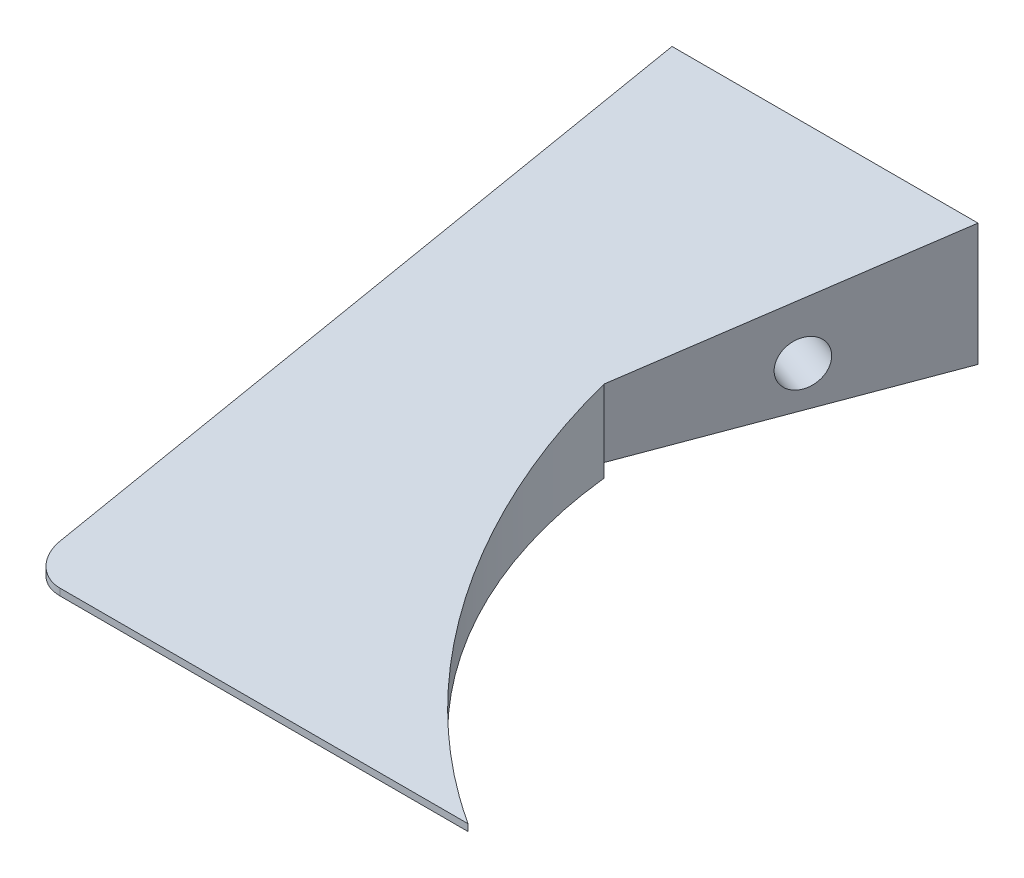
ISO-10303-21;
HEADER;
FILE_DESCRIPTION(('STEP AP214'),'2;1');
FILE_NAME('part.step','',(''),(''),'','','');
FILE_SCHEMA(('AUTOMOTIVE_DESIGN { 1 0 10303 214 1 1 1 1 }'));
ENDSEC;
DATA;
#1=APPLICATION_CONTEXT('core data for automotive mechanical design processes');
#2=APPLICATION_PROTOCOL_DEFINITION('international standard','automotive_design',2000,#1);
#3=PRODUCT_CONTEXT('',#1,'mechanical');
#4=PRODUCT('Part','Part','',(#3));
#5=PRODUCT_RELATED_PRODUCT_CATEGORY('part','',(#4));
#6=PRODUCT_DEFINITION_FORMATION('','',#4);
#7=PRODUCT_DEFINITION_CONTEXT('part definition',#1,'design');
#8=PRODUCT_DEFINITION('design','',#6,#7);
#9=PRODUCT_DEFINITION_SHAPE('','',#8);
#10=(LENGTH_UNIT() NAMED_UNIT(*) SI_UNIT(.MILLI.,.METRE.));
#11=(NAMED_UNIT(*) PLANE_ANGLE_UNIT() SI_UNIT($,.RADIAN.));
#12=(NAMED_UNIT(*) SI_UNIT($,.STERADIAN.) SOLID_ANGLE_UNIT());
#13=UNCERTAINTY_MEASURE_WITH_UNIT(LENGTH_MEASURE(1.E-05),#10,'distance_accuracy_value','');
#14=(GEOMETRIC_REPRESENTATION_CONTEXT(3) GLOBAL_UNCERTAINTY_ASSIGNED_CONTEXT((#13)) GLOBAL_UNIT_ASSIGNED_CONTEXT((#10,
#11,#12)) REPRESENTATION_CONTEXT('',''));
#15=CARTESIAN_POINT('',(0.,0.,0.));
#16=DIRECTION('',(0.,0.,1.));
#17=DIRECTION('',(1.,0.,0.));
#18=AXIS2_PLACEMENT_3D('',#15,#16,#17);
#19=CARTESIAN_POINT('',(0.,0.,95.));
#20=DIRECTION('',(0.,0.,1.));
#21=DIRECTION('',(1.,0.,0.));
#22=AXIS2_PLACEMENT_3D('',#19,#20,#21);
#23=PLANE('',#22);
#24=DIRECTION('',(1.,0.,0.));
#25=VECTOR('',#24,1.);
#26=CARTESIAN_POINT('',(-248.541518069349,-9.,95.));
#27=LINE('',#26,#25);
#28=CARTESIAN_POINT('',(-60.,-9.,95.));
#29=VERTEX_POINT('',#28);
#30=CARTESIAN_POINT('',(0.,-9.,95.));
#31=VERTEX_POINT('',#30);
#32=EDGE_CURVE('E157',#29,#31,#27,.T.);
#33=ORIENTED_EDGE('',*,*,#32,.F.);
#34=DIRECTION('',(0.,-1.,0.));
#35=VECTOR('',#34,1.);
#36=CARTESIAN_POINT('',(-60.,-10.,95.));
#37=LINE('',#36,#35);
#38=CARTESIAN_POINT('',(-60.,-10.,95.));
#39=VERTEX_POINT('',#38);
#40=EDGE_CURVE('E140',#29,#39,#37,.T.);
#41=ORIENTED_EDGE('',*,*,#40,.T.);
#42=DIRECTION('',(1.,0.,0.));
#43=VECTOR('',#42,1.);
#44=CARTESIAN_POINT('',(-65.,-10.,95.));
#45=LINE('',#44,#43);
#46=CARTESIAN_POINT('',(0.,-10.,95.));
#47=VERTEX_POINT('',#46);
#48=EDGE_CURVE('E135',#39,#47,#45,.T.);
#49=ORIENTED_EDGE('',*,*,#48,.T.);
#50=DIRECTION('',(0.,1.,0.));
#51=VECTOR('',#50,1.);
#52=CARTESIAN_POINT('',(0.,-10.001,95.));
#53=LINE('',#52,#51);
#54=EDGE_CURVE('E163',#47,#31,#53,.T.);
#55=ORIENTED_EDGE('',*,*,#54,.T.);
#56=EDGE_LOOP('',(#33,#41,#49,#55));
#57=FACE_BOUND('',#56,.T.);
#58=ADVANCED_FACE('F41',(#57),#23,.T.);
#59=CARTESIAN_POINT('',(-65.,10.,95.));
#60=DIRECTION('',(1.,0.,0.));
#61=DIRECTION('',(0.,0.,-1.));
#62=AXIS2_PLACEMENT_3D('',#59,#60,#61);
#63=PLANE('',#62);
#64=CARTESIAN_POINT('',(-65.,-2.,20.));
#65=DIRECTION('',(-1.,0.,0.));
#66=DIRECTION('',(0.,0.,1.));
#67=AXIS2_PLACEMENT_3D('',#64,#65,#66);
#68=CIRCLE('',#67,3.28999849999999);
#69=CARTESIAN_POINT('',(-65.,-2.,23.2899985));
#70=VERTEX_POINT('',#69);
#71=EDGE_CURVE('E206',#70,#70,#68,.T.);
#72=ORIENTED_EDGE('',*,*,#71,.F.);
#73=EDGE_LOOP('',(#72));
#74=FACE_BOUND('',#73,.T.);
#75=DIRECTION('',(0.,-1.,0.));
#76=VECTOR('',#75,1.);
#77=CARTESIAN_POINT('',(-65.,10.,0.));
#78=LINE('',#77,#76);
#79=CARTESIAN_POINT('',(-65.,10.,0.));
#80=VERTEX_POINT('',#79);
#81=CARTESIAN_POINT('',(-65.,-8.,0.));
#82=VERTEX_POINT('',#81);
#83=EDGE_CURVE('E142',#80,#82,#78,.T.);
#84=ORIENTED_EDGE('',*,*,#83,.T.);
#85=DIRECTION('',(0.,0.,-1.));
#86=VECTOR('',#85,1.);
#87=CARTESIAN_POINT('',(-65.,-8.,40.));
#88=LINE('',#87,#86);
#89=CARTESIAN_POINT('',(-65.,-8.,40.));
#90=VERTEX_POINT('',#89);
#91=EDGE_CURVE('E57',#90,#82,#88,.T.);
#92=ORIENTED_EDGE('',*,*,#91,.F.);
#93=DIRECTION('',(0.,1.,0.));
#94=VECTOR('',#93,1.);
#95=CARTESIAN_POINT('',(-65.,-8.,40.));
#96=LINE('',#95,#94);
#97=CARTESIAN_POINT('',(-65.,-10.,40.));
#98=VERTEX_POINT('',#97);
#99=EDGE_CURVE('E114',#98,#90,#96,.T.);
#100=ORIENTED_EDGE('',*,*,#99,.F.);
#101=DIRECTION('',(0.,0.,-1.));
#102=VECTOR('',#101,1.);
#103=CARTESIAN_POINT('',(-65.,-10.,95.));
#104=LINE('',#103,#102);
#105=CARTESIAN_POINT('',(-65.,-10.,90.));
#106=VERTEX_POINT('',#105);
#107=EDGE_CURVE('E126',#106,#98,#104,.T.);
#108=ORIENTED_EDGE('',*,*,#107,.F.);
#109=DIRECTION('',(0.,-1.,0.));
#110=VECTOR('',#109,1.);
#111=CARTESIAN_POINT('',(-65.,-9.,90.));
#112=LINE('',#111,#110);
#113=CARTESIAN_POINT('',(-65.,-8.,90.));
#114=VERTEX_POINT('',#113);
#115=EDGE_CURVE('E50',#106,#114,#112,.F.);
#116=ORIENTED_EDGE('',*,*,#115,.T.);
#117=DIRECTION('',(0.,-0.196116135138184,0.98058067569092));
#118=VECTOR('',#117,1.);
#119=CARTESIAN_POINT('',(-65.,-8.26923076923077,91.3461538461538));
#120=LINE('',#119,#118);
#121=EDGE_CURVE('E164',#80,#114,#120,.T.);
#122=ORIENTED_EDGE('',*,*,#121,.F.);
#123=EDGE_LOOP('',(#84,#92,#100,#108,#116,#122));
#124=FACE_BOUND('',#123,.T.);
#125=ADVANCED_FACE('F125',(#74,#124),#63,.F.);
#126=CARTESIAN_POINT('',(38.0509567631235,-10.001,32.1493911507396));
#127=DIRECTION('',(0.,1.,0.));
#128=DIRECTION('',(0.,0.,1.));
#129=AXIS2_PLACEMENT_3D('',#126,#127,#128);
#130=CYLINDRICAL_SURFACE('',#129,73.4715886810121);
#131=DIRECTION('',(0.,1.,0.));
#132=VECTOR('',#131,1.);
#133=CARTESIAN_POINT('',(-35.,-10.001,40.));
#134=LINE('',#133,#132);
#135=CARTESIAN_POINT('',(-35.,-10.,40.));
#136=VERTEX_POINT('',#135);
#137=CARTESIAN_POINT('',(-35.,-8.,40.));
#138=VERTEX_POINT('',#137);
#139=EDGE_CURVE('E116',#136,#138,#134,.T.);
#140=ORIENTED_EDGE('',*,*,#139,.T.);
#141=CARTESIAN_POINT('',(-35.,2.,40.));
#142=VERTEX_POINT('',#141);
#143=EDGE_CURVE('E176',#138,#142,#134,.T.);
#144=ORIENTED_EDGE('',*,*,#143,.T.);
#145=CARTESIAN_POINT('',(38.0509567631235,3.57012176985208,32.1493911507396));
#146=DIRECTION('',(0.,0.98058067569092,0.196116135138184));
#147=DIRECTION('',(0.,0.196116135138184,-0.98058067569092));
#148=AXIS2_PLACEMENT_3D('',#145,#146,#147);
#149=ELLIPSE('',#148,74.9266128758287,73.4715886810121);
#150=EDGE_CURVE('E170',#142,#31,#149,.T.);
#151=ORIENTED_EDGE('',*,*,#150,.T.);
#152=ORIENTED_EDGE('',*,*,#54,.F.);
#153=CARTESIAN_POINT('',(38.0509567631235,-10.,32.1493911507396));
#154=DIRECTION('',(0.,1.,0.));
#155=DIRECTION('',(0.,0.,1.));
#156=AXIS2_PLACEMENT_3D('',#153,#154,#155);
#157=CIRCLE('',#156,73.4715886810121);
#158=EDGE_CURVE('E160',#136,#47,#157,.T.);
#159=ORIENTED_EDGE('',*,*,#158,.F.);
#160=EDGE_LOOP('',(#140,#144,#151,#152,#159));
#161=FACE_BOUND('',#160,.T.);
#162=ADVANCED_FACE('F218',(#161),#130,.F.);
#163=CARTESIAN_POINT('',(-35.,-10.001,40.));
#164=DIRECTION('',(0.936329177569045,0.,0.351123441588392));
#165=DIRECTION('',(0.351123441588392,0.,-0.936329177569045));
#166=AXIS2_PLACEMENT_3D('',#163,#164,#165);
#167=PLANE('',#166);
#168=DIRECTION('',(-0.351123441588392,0.,0.936329177569045));
#169=VECTOR('',#168,1.);
#170=CARTESIAN_POINT('',(-35.,-8.,40.));
#171=LINE('',#170,#169);
#172=CARTESIAN_POINT('',(-20.,-8.,0.));
#173=VERTEX_POINT('',#172);
#174=EDGE_CURVE('E195',#173,#138,#171,.T.);
#175=ORIENTED_EDGE('',*,*,#174,.F.);
#176=DIRECTION('',(0.,1.,0.));
#177=VECTOR('',#176,1.);
#178=CARTESIAN_POINT('',(-20.,-10.001,0.));
#179=LINE('',#178,#177);
#180=CARTESIAN_POINT('',(-20.,10.,0.));
#181=VERTEX_POINT('',#180);
#182=EDGE_CURVE('E168',#173,#181,#179,.T.);
#183=ORIENTED_EDGE('',*,*,#182,.T.);
#184=DIRECTION('',(-0.345124094421928,-0.184066183691695,0.920330918458474));
#185=VECTOR('',#184,1.);
#186=CARTESIAN_POINT('',(-35.7623716251985,1.59340179989412,42.0329910005294));
#187=LINE('',#186,#185);
#188=EDGE_CURVE('E134',#181,#142,#187,.T.);
#189=ORIENTED_EDGE('',*,*,#188,.T.);
#190=ORIENTED_EDGE('',*,*,#143,.F.);
#191=EDGE_LOOP('',(#175,#183,#189,#190));
#192=FACE_BOUND('',#191,.T.);
#193=CARTESIAN_POINT('',(-27.0224688317678,-2.,18.7265835513809));
#194=DIRECTION('',(0.936329177569045,0.,0.351123441588392));
#195=DIRECTION('',(0.351123441588392,0.,-0.936329177569045));
#196=AXIS2_PLACEMENT_3D('',#193,#194,#195);
#197=CIRCLE('',#196,3.28999849999999);
#198=CARTESIAN_POINT('',(-25.8672732356272,-2.,15.6460619616725));
#199=VERTEX_POINT('',#198);
#200=EDGE_CURVE('E198',#199,#199,#197,.T.);
#201=ORIENTED_EDGE('',*,*,#200,.F.);
#202=EDGE_LOOP('',(#201));
#203=FACE_BOUND('',#202,.T.);
#204=ADVANCED_FACE('F222',(#192,#203),#167,.T.);
#205=CARTESIAN_POINT('',(-65.,-10.,95.));
#206=DIRECTION('',(0.,1.,0.));
#207=DIRECTION('',(0.,0.,1.));
#208=AXIS2_PLACEMENT_3D('',#205,#206,#207);
#209=PLANE('',#208);
#210=ORIENTED_EDGE('',*,*,#107,.T.);
#211=DIRECTION('',(-1.,0.,0.));
#212=VECTOR('',#211,1.);
#213=CARTESIAN_POINT('',(-65.,-10.,40.));
#214=LINE('',#213,#212);
#215=EDGE_CURVE('E110',#136,#98,#214,.T.);
#216=ORIENTED_EDGE('',*,*,#215,.F.);
#217=ORIENTED_EDGE('',*,*,#158,.T.);
#218=ORIENTED_EDGE('',*,*,#48,.F.);
#219=CARTESIAN_POINT('',(-60.,-10.,90.));
#220=DIRECTION('',(0.,1.,0.));
#221=DIRECTION('',(0.,0.,1.));
#222=AXIS2_PLACEMENT_3D('',#219,#220,#221);
#223=CIRCLE('',#222,5.);
#224=EDGE_CURVE('E132',#39,#106,#223,.F.);
#225=ORIENTED_EDGE('',*,*,#224,.T.);
#226=EDGE_LOOP('',(#210,#216,#217,#218,#225));
#227=FACE_BOUND('',#226,.T.);
#228=ADVANCED_FACE('F130',(#227),#209,.F.);
#229=CARTESIAN_POINT('',(0.,0.,0.));
#230=DIRECTION('',(0.,0.,1.));
#231=DIRECTION('',(1.,0.,0.));
#232=AXIS2_PLACEMENT_3D('',#229,#230,#231);
#233=PLANE('',#232);
#234=ORIENTED_EDGE('',*,*,#182,.F.);
#235=DIRECTION('',(1.,0.,0.));
#236=VECTOR('',#235,1.);
#237=CARTESIAN_POINT('',(-20.,-8.,0.));
#238=LINE('',#237,#236);
#239=EDGE_CURVE('E122',#82,#173,#238,.T.);
#240=ORIENTED_EDGE('',*,*,#239,.F.);
#241=ORIENTED_EDGE('',*,*,#83,.F.);
#242=DIRECTION('',(-1.,0.,0.));
#243=VECTOR('',#242,1.);
#244=CARTESIAN_POINT('',(-65.,10.,0.));
#245=LINE('',#244,#243);
#246=EDGE_CURVE('E178',#181,#80,#245,.T.);
#247=ORIENTED_EDGE('',*,*,#246,.F.);
#248=EDGE_LOOP('',(#234,#240,#241,#247));
#249=FACE_BOUND('',#248,.T.);
#250=ADVANCED_FACE('F187',(#249),#233,.F.);
#251=CARTESIAN_POINT('',(-248.541518069349,10.,0.));
#252=DIRECTION('',(0.,0.98058067569092,0.196116135138184));
#253=DIRECTION('',(0.,-0.196116135138184,0.98058067569092));
#254=AXIS2_PLACEMENT_3D('',#251,#252,#253);
#255=PLANE('',#254);
#256=ORIENTED_EDGE('',*,*,#121,.T.);
#257=CARTESIAN_POINT('',(-60.,-8.,90.));
#258=DIRECTION('',(0.,0.98058067569092,0.196116135138184));
#259=DIRECTION('',(0.,0.196116135138184,-0.98058067569092));
#260=AXIS2_PLACEMENT_3D('',#257,#258,#259);
#261=ELLIPSE('',#260,5.09901951359278,5.);
#262=EDGE_CURVE('E11',#114,#29,#261,.T.);
#263=ORIENTED_EDGE('',*,*,#262,.T.);
#264=ORIENTED_EDGE('',*,*,#32,.T.);
#265=ORIENTED_EDGE('',*,*,#150,.F.);
#266=ORIENTED_EDGE('',*,*,#188,.F.);
#267=ORIENTED_EDGE('',*,*,#246,.T.);
#268=EDGE_LOOP('',(#256,#263,#264,#265,#266,#267));
#269=FACE_BOUND('',#268,.T.);
#270=ADVANCED_FACE('F220',(#269),#255,.T.);
#271=CARTESIAN_POINT('',(-55.,-2.,20.));
#272=DIRECTION('',(-1.,0.,0.));
#273=DIRECTION('',(0.,0.,1.));
#274=AXIS2_PLACEMENT_3D('',#271,#272,#273);
#275=CONICAL_SURFACE('',#274,3.28999849999999,1.02974425867665);
#276=CARTESIAN_POINT('',(-53.0231694646903,-2.,20.));
#277=VERTEX_POINT('',#276);
#278=VERTEX_LOOP('',#277);
#279=FACE_BOUND('',#278,.T.);
#280=CARTESIAN_POINT('',(-55.,-2.,20.));
#281=DIRECTION('',(-1.,0.,0.));
#282=DIRECTION('',(0.,0.,1.));
#283=AXIS2_PLACEMENT_3D('',#280,#281,#282);
#284=CIRCLE('',#283,3.28999849999999);
#285=CARTESIAN_POINT('',(-55.,-2.,23.2899985));
#286=VERTEX_POINT('',#285);
#287=EDGE_CURVE('E210',#286,#286,#284,.T.);
#288=ORIENTED_EDGE('',*,*,#287,.T.);
#289=EDGE_LOOP('',(#288));
#290=FACE_BOUND('',#289,.T.);
#291=ADVANCED_FACE('F256',(#279,#290),#275,.F.);
#292=CARTESIAN_POINT('',(-65.,-2.,20.));
#293=DIRECTION('',(-1.,0.,0.));
#294=DIRECTION('',(0.,0.,1.));
#295=AXIS2_PLACEMENT_3D('',#292,#293,#294);
#296=CYLINDRICAL_SURFACE('',#295,3.28999849999999);
#297=ORIENTED_EDGE('',*,*,#287,.F.);
#298=EDGE_LOOP('',(#297));
#299=FACE_BOUND('',#298,.T.);
#300=ORIENTED_EDGE('',*,*,#71,.T.);
#301=EDGE_LOOP('',(#300));
#302=FACE_BOUND('',#301,.T.);
#303=ADVANCED_FACE('F259',(#299,#302),#296,.F.);
#304=CARTESIAN_POINT('',(-36.3857606074583,-2.,15.215349135497));
#305=DIRECTION('',(0.936329177569045,0.,0.351123441588392));
#306=DIRECTION('',(0.351123441588392,0.,-0.936329177569045));
#307=AXIS2_PLACEMENT_3D('',#304,#305,#306);
#308=CONICAL_SURFACE('',#307,3.28999849999999,1.02974425867665);
#309=CARTESIAN_POINT('',(-38.2367247167782,-2.,14.521237594502));
#310=VERTEX_POINT('',#309);
#311=VERTEX_LOOP('',#310);
#312=FACE_BOUND('',#311,.T.);
#313=CARTESIAN_POINT('',(-36.3857606074583,-2.,15.215349135497));
#314=DIRECTION('',(0.936329177569045,0.,0.351123441588392));
#315=DIRECTION('',(0.351123441588392,0.,-0.936329177569045));
#316=AXIS2_PLACEMENT_3D('',#313,#314,#315);
#317=CIRCLE('',#316,3.28999849999999);
#318=CARTESIAN_POINT('',(-35.2305650113176,-2.,12.1348275457886));
#319=VERTEX_POINT('',#318);
#320=EDGE_CURVE('E202',#319,#319,#317,.T.);
#321=ORIENTED_EDGE('',*,*,#320,.T.);
#322=EDGE_LOOP('',(#321));
#323=FACE_BOUND('',#322,.T.);
#324=ADVANCED_FACE('F263',(#312,#323),#308,.F.);
#325=CARTESIAN_POINT('',(-27.0224688317678,-2.,18.7265835513809));
#326=DIRECTION('',(0.936329177569045,0.,0.351123441588392));
#327=DIRECTION('',(0.351123441588392,0.,-0.936329177569045));
#328=AXIS2_PLACEMENT_3D('',#325,#326,#327);
#329=CYLINDRICAL_SURFACE('',#328,3.28999849999999);
#330=ORIENTED_EDGE('',*,*,#320,.F.);
#331=EDGE_LOOP('',(#330));
#332=FACE_BOUND('',#331,.T.);
#333=ORIENTED_EDGE('',*,*,#200,.T.);
#334=EDGE_LOOP('',(#333));
#335=FACE_BOUND('',#334,.T.);
#336=ADVANCED_FACE('F233',(#332,#335),#329,.F.);
#337=CARTESIAN_POINT('',(-60.,0.,90.));
#338=DIRECTION('',(0.,1.,0.));
#339=DIRECTION('',(0.,0.,1.));
#340=AXIS2_PLACEMENT_3D('',#337,#338,#339);
#341=CYLINDRICAL_SURFACE('',#340,5.);
#342=ORIENTED_EDGE('',*,*,#262,.F.);
#343=ORIENTED_EDGE('',*,*,#115,.F.);
#344=ORIENTED_EDGE('',*,*,#224,.F.);
#345=ORIENTED_EDGE('',*,*,#40,.F.);
#346=EDGE_LOOP('',(#342,#343,#344,#345));
#347=FACE_BOUND('',#346,.T.);
#348=ADVANCED_FACE('F43',(#347),#341,.T.);
#349=CARTESIAN_POINT('',(-20.,-8.,40.));
#350=DIRECTION('',(0.,1.,0.));
#351=DIRECTION('',(0.,0.,1.));
#352=AXIS2_PLACEMENT_3D('',#349,#350,#351);
#353=PLANE('',#352);
#354=ORIENTED_EDGE('',*,*,#174,.T.);
#355=DIRECTION('',(1.,0.,0.));
#356=VECTOR('',#355,1.);
#357=CARTESIAN_POINT('',(-20.,-8.,40.));
#358=LINE('',#357,#356);
#359=EDGE_CURVE('E128',#90,#138,#358,.T.);
#360=ORIENTED_EDGE('',*,*,#359,.F.);
#361=ORIENTED_EDGE('',*,*,#91,.T.);
#362=ORIENTED_EDGE('',*,*,#239,.T.);
#363=EDGE_LOOP('',(#354,#360,#361,#362));
#364=FACE_BOUND('',#363,.T.);
#365=ADVANCED_FACE('F224',(#364),#353,.F.);
#366=CARTESIAN_POINT('',(0.,0.,40.));
#367=DIRECTION('',(0.,0.,1.));
#368=DIRECTION('',(1.,0.,0.));
#369=AXIS2_PLACEMENT_3D('',#366,#367,#368);
#370=PLANE('',#369);
#371=ORIENTED_EDGE('',*,*,#139,.F.);
#372=ORIENTED_EDGE('',*,*,#215,.T.);
#373=ORIENTED_EDGE('',*,*,#99,.T.);
#374=ORIENTED_EDGE('',*,*,#359,.T.);
#375=EDGE_LOOP('',(#371,#372,#373,#374));
#376=FACE_BOUND('',#375,.T.);
#377=ADVANCED_FACE('F112',(#376),#370,.F.);
#378=CLOSED_SHELL('',(#58,#125,#162,#204,#228,#250,#270,#291,#303,#324,#336,#348,#365,#377));
#379=MANIFOLD_SOLID_BREP('B2',#378);
#380=ADVANCED_BREP_SHAPE_REPRESENTATION('',(#18,#379),#14);
#381=SHAPE_DEFINITION_REPRESENTATION(#9,#380);
ENDSEC;
END-ISO-10303-21;
